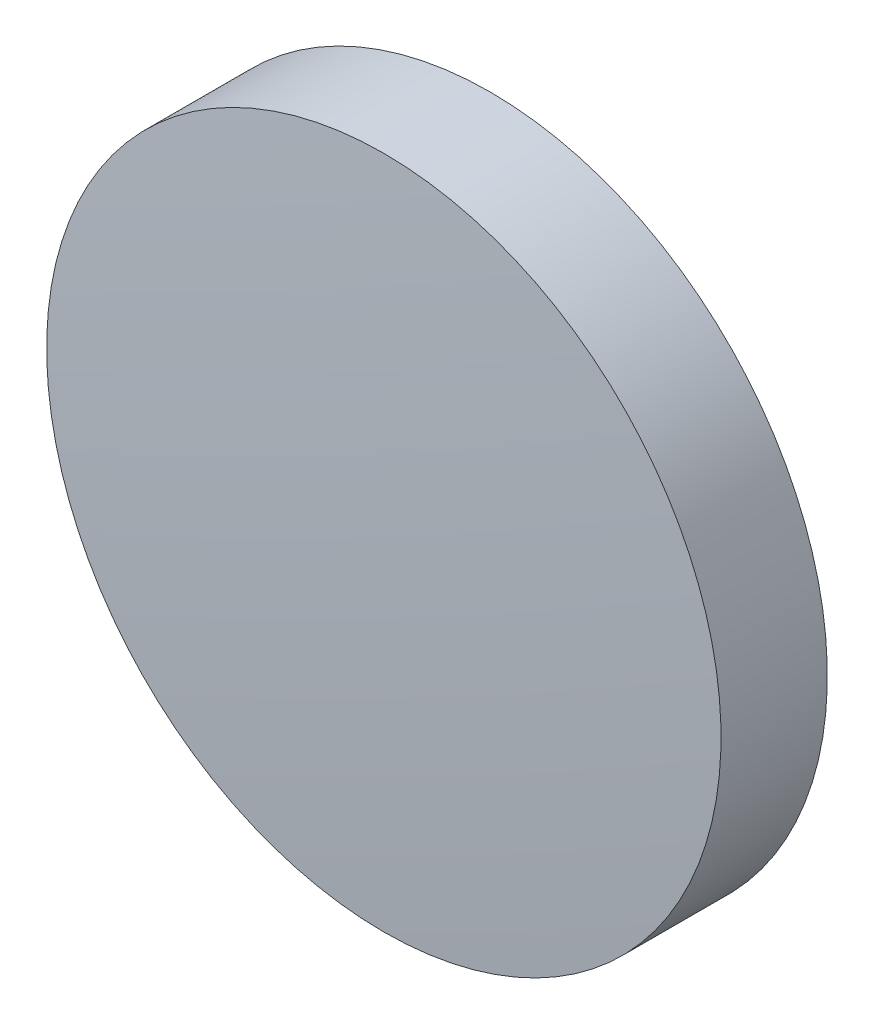
ISO-10303-21;
HEADER;
FILE_DESCRIPTION(('STEP AP214'),'2;1');
FILE_NAME('part.step','',(''),(''),'','','');
FILE_SCHEMA(('AUTOMOTIVE_DESIGN { 1 0 10303 214 1 1 1 1 }'));
ENDSEC;
DATA;
#1=APPLICATION_CONTEXT('core data for automotive mechanical design processes');
#2=APPLICATION_PROTOCOL_DEFINITION('international standard','automotive_design',2000,#1);
#3=PRODUCT_CONTEXT('',#1,'mechanical');
#4=PRODUCT('Part','Part','',(#3));
#5=PRODUCT_RELATED_PRODUCT_CATEGORY('part','',(#4));
#6=PRODUCT_DEFINITION_FORMATION('','',#4);
#7=PRODUCT_DEFINITION_CONTEXT('part definition',#1,'design');
#8=PRODUCT_DEFINITION('design','',#6,#7);
#9=PRODUCT_DEFINITION_SHAPE('','',#8);
#10=(LENGTH_UNIT() NAMED_UNIT(*) SI_UNIT(.MILLI.,.METRE.));
#11=(NAMED_UNIT(*) PLANE_ANGLE_UNIT() SI_UNIT($,.RADIAN.));
#12=(NAMED_UNIT(*) SI_UNIT($,.STERADIAN.) SOLID_ANGLE_UNIT());
#13=UNCERTAINTY_MEASURE_WITH_UNIT(LENGTH_MEASURE(1.E-05),#10,'distance_accuracy_value','');
#14=(GEOMETRIC_REPRESENTATION_CONTEXT(3) GLOBAL_UNCERTAINTY_ASSIGNED_CONTEXT((#13)) GLOBAL_UNIT_ASSIGNED_CONTEXT((#10,
#11,#12)) REPRESENTATION_CONTEXT('',''));
#15=CARTESIAN_POINT('',(0.,0.,0.));
#16=DIRECTION('',(0.,0.,1.));
#17=DIRECTION('',(1.,0.,0.));
#18=AXIS2_PLACEMENT_3D('',#15,#16,#17);
#19=CARTESIAN_POINT('',(0.,0.,-1.085));
#20=DIRECTION('',(0.,0.,-1.));
#21=DIRECTION('',(0.,1.,0.));
#22=AXIS2_PLACEMENT_3D('',#19,#20,#21);
#23=PLANE('',#22);
#24=CARTESIAN_POINT('',(0.,0.,-1.085));
#25=DIRECTION('',(0.,0.,-1.));
#26=DIRECTION('',(0.,1.,0.));
#27=AXIS2_PLACEMENT_3D('',#24,#25,#26);
#28=CIRCLE('',#27,6.35);
#29=CARTESIAN_POINT('',(0.,6.35,-1.085));
#30=VERTEX_POINT('',#29);
#31=EDGE_CURVE('E36',#30,#30,#28,.T.);
#32=ORIENTED_EDGE('',*,*,#31,.T.);
#33=EDGE_LOOP('',(#32));
#34=FACE_BOUND('',#33,.T.);
#35=ADVANCED_FACE('F30',(#34),#23,.T.);
#36=CARTESIAN_POINT('',(0.,0.,-119.07));
#37=DIRECTION('',(0.,0.,-1.));
#38=DIRECTION('',(0.,1.,0.));
#39=AXIS2_PLACEMENT_3D('',#36,#37,#38);
#40=SPHERICAL_SURFACE('',#39,120.155);
#41=CARTESIAN_POINT('',(0.,0.,0.917088992941404));
#42=DIRECTION('',(0.,0.,-1.));
#43=DIRECTION('',(0.,1.,0.));
#44=AXIS2_PLACEMENT_3D('',#41,#42,#43);
#45=CIRCLE('',#44,6.34999999999999);
#46=CARTESIAN_POINT('',(0.,6.34999999999999,0.917088992941406));
#47=VERTEX_POINT('',#46);
#48=EDGE_CURVE('E10',#47,#47,#45,.T.);
#49=ORIENTED_EDGE('',*,*,#48,.F.);
#50=EDGE_LOOP('',(#49));
#51=FACE_BOUND('',#50,.T.);
#52=ADVANCED_FACE('F45',(#51),#40,.T.);
#53=CARTESIAN_POINT('',(0.,0.,-1.085));
#54=DIRECTION('',(0.,0.,-1.));
#55=DIRECTION('',(0.,1.,0.));
#56=AXIS2_PLACEMENT_3D('',#53,#54,#55);
#57=CYLINDRICAL_SURFACE('',#56,6.35);
#58=ORIENTED_EDGE('',*,*,#48,.T.);
#59=EDGE_LOOP('',(#58));
#60=FACE_BOUND('',#59,.T.);
#61=ORIENTED_EDGE('',*,*,#31,.F.);
#62=EDGE_LOOP('',(#61));
#63=FACE_BOUND('',#62,.T.);
#64=ADVANCED_FACE('F43',(#60,#63),#57,.T.);
#65=CLOSED_SHELL('',(#35,#52,#64));
#66=MANIFOLD_SOLID_BREP('B2',#65);
#67=ADVANCED_BREP_SHAPE_REPRESENTATION('',(#18,#66),#14);
#68=SHAPE_DEFINITION_REPRESENTATION(#9,#67);
ENDSEC;
END-ISO-10303-21;
